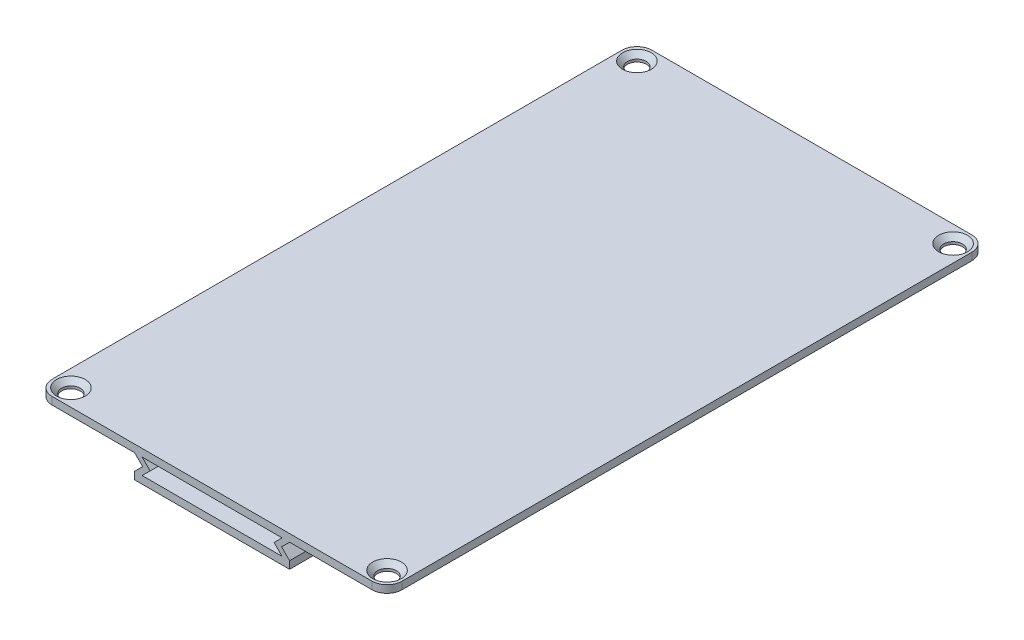
ISO-10303-21;
HEADER;
FILE_DESCRIPTION(('STEP AP214'),'2;1');
FILE_NAME('part.step','',(''),(''),'','','');
FILE_SCHEMA(('AUTOMOTIVE_DESIGN { 1 0 10303 214 1 1 1 1 }'));
ENDSEC;
DATA;
#1=APPLICATION_CONTEXT('core data for automotive mechanical design processes');
#2=APPLICATION_PROTOCOL_DEFINITION('international standard','automotive_design',2000,#1);
#3=PRODUCT_CONTEXT('',#1,'mechanical');
#4=PRODUCT('Part','Part','',(#3));
#5=PRODUCT_RELATED_PRODUCT_CATEGORY('part','',(#4));
#6=PRODUCT_DEFINITION_FORMATION('','',#4);
#7=PRODUCT_DEFINITION_CONTEXT('part definition',#1,'design');
#8=PRODUCT_DEFINITION('design','',#6,#7);
#9=PRODUCT_DEFINITION_SHAPE('','',#8);
#10=(LENGTH_UNIT() NAMED_UNIT(*) SI_UNIT(.MILLI.,.METRE.));
#11=(NAMED_UNIT(*) PLANE_ANGLE_UNIT() SI_UNIT($,.RADIAN.));
#12=(NAMED_UNIT(*) SI_UNIT($,.STERADIAN.) SOLID_ANGLE_UNIT());
#13=UNCERTAINTY_MEASURE_WITH_UNIT(LENGTH_MEASURE(1.E-05),#10,'distance_accuracy_value','');
#14=(GEOMETRIC_REPRESENTATION_CONTEXT(3) GLOBAL_UNCERTAINTY_ASSIGNED_CONTEXT((#13)) GLOBAL_UNIT_ASSIGNED_CONTEXT((#10,
#11,#12)) REPRESENTATION_CONTEXT('',''));
#15=CARTESIAN_POINT('',(0.,0.,0.));
#16=DIRECTION('',(0.,0.,1.));
#17=DIRECTION('',(1.,0.,0.));
#18=AXIS2_PLACEMENT_3D('',#15,#16,#17);
#19=CARTESIAN_POINT('',(0.,0.,60.));
#20=DIRECTION('',(0.,-1.,0.));
#21=DIRECTION('',(0.,0.,-1.));
#22=AXIS2_PLACEMENT_3D('',#19,#20,#21);
#23=PLANE('',#22);
#24=CARTESIAN_POINT('',(-31.625,0.,56.625));
#25=DIRECTION('',(0.,-1.,0.));
#26=DIRECTION('',(0.,0.,-1.));
#27=AXIS2_PLACEMENT_3D('',#24,#25,#26);
#28=CIRCLE('',#27,2.87499999999993);
#29=CARTESIAN_POINT('',(-31.625,0.,53.7500000000001));
#30=VERTEX_POINT('',#29);
#31=EDGE_CURVE('E341',#30,#30,#28,.T.);
#32=ORIENTED_EDGE('',*,*,#31,.T.);
#33=EDGE_LOOP('',(#32));
#34=FACE_BOUND('',#33,.T.);
#35=CARTESIAN_POINT('',(31.625,0.,56.625));
#36=DIRECTION('',(0.,-1.,0.));
#37=DIRECTION('',(0.,0.,-1.));
#38=AXIS2_PLACEMENT_3D('',#35,#36,#37);
#39=CIRCLE('',#38,2.87500000000003);
#40=CARTESIAN_POINT('',(31.625,0.,53.75));
#41=VERTEX_POINT('',#40);
#42=EDGE_CURVE('E338',#41,#41,#39,.T.);
#43=ORIENTED_EDGE('',*,*,#42,.T.);
#44=EDGE_LOOP('',(#43));
#45=FACE_BOUND('',#44,.T.);
#46=CARTESIAN_POINT('',(31.625,0.,-56.625));
#47=DIRECTION('',(0.,-1.,0.));
#48=DIRECTION('',(0.,0.,-1.));
#49=AXIS2_PLACEMENT_3D('',#46,#47,#48);
#50=CIRCLE('',#49,2.87500000000003);
#51=CARTESIAN_POINT('',(31.625,0.,-59.5));
#52=VERTEX_POINT('',#51);
#53=EDGE_CURVE('E335',#52,#52,#50,.T.);
#54=ORIENTED_EDGE('',*,*,#53,.T.);
#55=EDGE_LOOP('',(#54));
#56=FACE_BOUND('',#55,.T.);
#57=CARTESIAN_POINT('',(-31.625,0.,-56.625));
#58=DIRECTION('',(0.,-1.,0.));
#59=DIRECTION('',(0.,0.,-1.));
#60=AXIS2_PLACEMENT_3D('',#57,#58,#59);
#61=CIRCLE('',#60,2.87499999999997);
#62=CARTESIAN_POINT('',(-31.625,0.,-59.5));
#63=VERTEX_POINT('',#62);
#64=EDGE_CURVE('E323',#63,#63,#61,.T.);
#65=ORIENTED_EDGE('',*,*,#64,.T.);
#66=EDGE_LOOP('',(#65));
#67=FACE_BOUND('',#66,.T.);
#68=DIRECTION('',(-1.,0.,0.));
#69=VECTOR('',#68,1.);
#70=CARTESIAN_POINT('',(0.,0.,-60.));
#71=LINE('',#70,#69);
#72=CARTESIAN_POINT('',(32.,0.,-60.));
#73=VERTEX_POINT('',#72);
#74=CARTESIAN_POINT('',(-32.,0.,-60.));
#75=VERTEX_POINT('',#74);
#76=EDGE_CURVE('E277',#73,#75,#71,.T.);
#77=ORIENTED_EDGE('',*,*,#76,.T.);
#78=CARTESIAN_POINT('',(-32.,0.,-57.));
#79=DIRECTION('',(0.,-1.,0.));
#80=DIRECTION('',(0.,0.,-1.));
#81=AXIS2_PLACEMENT_3D('',#78,#79,#80);
#82=CIRCLE('',#81,3.);
#83=CARTESIAN_POINT('',(-35.,0.,-57.));
#84=VERTEX_POINT('',#83);
#85=EDGE_CURVE('E376',#75,#84,#82,.F.);
#86=ORIENTED_EDGE('',*,*,#85,.T.);
#87=DIRECTION('',(0.,0.,-1.));
#88=VECTOR('',#87,1.);
#89=CARTESIAN_POINT('',(-35.,0.,60.));
#90=LINE('',#89,#88);
#91=CARTESIAN_POINT('',(-35.,0.,57.));
#92=VERTEX_POINT('',#91);
#93=EDGE_CURVE('E320',#92,#84,#90,.T.);
#94=ORIENTED_EDGE('',*,*,#93,.F.);
#95=CARTESIAN_POINT('',(-32.,0.,57.));
#96=DIRECTION('',(0.,-1.,0.));
#97=DIRECTION('',(0.,0.,-1.));
#98=AXIS2_PLACEMENT_3D('',#95,#96,#97);
#99=CIRCLE('',#98,3.);
#100=CARTESIAN_POINT('',(-32.,0.,60.));
#101=VERTEX_POINT('',#100);
#102=EDGE_CURVE('E370',#92,#101,#99,.F.);
#103=ORIENTED_EDGE('',*,*,#102,.T.);
#104=DIRECTION('',(-1.,0.,0.));
#105=VECTOR('',#104,1.);
#106=CARTESIAN_POINT('',(0.,0.,60.));
#107=LINE('',#106,#105);
#108=CARTESIAN_POINT('',(32.,0.,60.));
#109=VERTEX_POINT('',#108);
#110=EDGE_CURVE('E259',#109,#101,#107,.T.);
#111=ORIENTED_EDGE('',*,*,#110,.F.);
#112=CARTESIAN_POINT('',(32.,0.,57.));
#113=DIRECTION('',(0.,-1.,0.));
#114=DIRECTION('',(0.,0.,-1.));
#115=AXIS2_PLACEMENT_3D('',#112,#113,#114);
#116=CIRCLE('',#115,3.);
#117=CARTESIAN_POINT('',(35.,0.,57.));
#118=VERTEX_POINT('',#117);
#119=EDGE_CURVE('E372',#109,#118,#116,.F.);
#120=ORIENTED_EDGE('',*,*,#119,.T.);
#121=DIRECTION('',(0.,0.,-1.));
#122=VECTOR('',#121,1.);
#123=CARTESIAN_POINT('',(35.,0.,60.));
#124=LINE('',#123,#122);
#125=CARTESIAN_POINT('',(35.,0.,-57.));
#126=VERTEX_POINT('',#125);
#127=EDGE_CURVE('E226',#118,#126,#124,.T.);
#128=ORIENTED_EDGE('',*,*,#127,.T.);
#129=CARTESIAN_POINT('',(32.,0.,-57.));
#130=DIRECTION('',(0.,-1.,0.));
#131=DIRECTION('',(0.,0.,-1.));
#132=AXIS2_PLACEMENT_3D('',#129,#130,#131);
#133=CIRCLE('',#132,3.);
#134=EDGE_CURVE('E374',#126,#73,#133,.F.);
#135=ORIENTED_EDGE('',*,*,#134,.T.);
#136=EDGE_LOOP('',(#77,#86,#94,#103,#111,#120,#128,#135));
#137=FACE_BOUND('',#136,.T.);
#138=ADVANCED_FACE('F35',(#34,#45,#56,#67,#137),#23,.F.);
#139=CARTESIAN_POINT('',(-35.,0.,60.));
#140=DIRECTION('',(1.,0.,0.));
#141=DIRECTION('',(0.,0.,-1.));
#142=AXIS2_PLACEMENT_3D('',#139,#140,#141);
#143=PLANE('',#142);
#144=ORIENTED_EDGE('',*,*,#93,.T.);
#145=DIRECTION('',(0.,-1.,0.));
#146=VECTOR('',#145,1.);
#147=CARTESIAN_POINT('',(-35.,-1.5,-57.));
#148=LINE('',#147,#146);
#149=CARTESIAN_POINT('',(-35.,-1.5,-57.));
#150=VERTEX_POINT('',#149);
#151=EDGE_CURVE('E358',#84,#150,#148,.T.);
#152=ORIENTED_EDGE('',*,*,#151,.T.);
#153=DIRECTION('',(0.,0.,-1.));
#154=VECTOR('',#153,1.);
#155=CARTESIAN_POINT('',(-35.,-1.5,60.));
#156=LINE('',#155,#154);
#157=CARTESIAN_POINT('',(-35.,-1.5,57.));
#158=VERTEX_POINT('',#157);
#159=EDGE_CURVE('E317',#158,#150,#156,.T.);
#160=ORIENTED_EDGE('',*,*,#159,.F.);
#161=DIRECTION('',(0.,-1.,0.));
#162=VECTOR('',#161,1.);
#163=CARTESIAN_POINT('',(-35.,0.,57.));
#164=LINE('',#163,#162);
#165=EDGE_CURVE('E356',#158,#92,#164,.F.);
#166=ORIENTED_EDGE('',*,*,#165,.T.);
#167=EDGE_LOOP('',(#144,#152,#160,#166));
#168=FACE_BOUND('',#167,.T.);
#169=ADVANCED_FACE('F453',(#168),#143,.F.);
#170=CARTESIAN_POINT('',(-35.,-1.5,60.));
#171=DIRECTION('',(0.,1.,0.));
#172=DIRECTION('',(0.,0.,1.));
#173=AXIS2_PLACEMENT_3D('',#170,#171,#172);
#174=PLANE('',#173);
#175=CARTESIAN_POINT('',(-31.625,-1.5,-56.625));
#176=DIRECTION('',(0.,1.,0.));
#177=DIRECTION('',(0.,0.,1.));
#178=AXIS2_PLACEMENT_3D('',#175,#176,#177);
#179=CIRCLE('',#178,1.875);
#180=CARTESIAN_POINT('',(-31.625,-1.5,-54.75));
#181=VERTEX_POINT('',#180);
#182=EDGE_CURVE('E281',#181,#181,#179,.T.);
#183=ORIENTED_EDGE('',*,*,#182,.T.);
#184=EDGE_LOOP('',(#183));
#185=FACE_BOUND('',#184,.T.);
#186=CARTESIAN_POINT('',(-31.625,-1.5,56.625));
#187=DIRECTION('',(0.,1.,0.));
#188=DIRECTION('',(0.,0.,1.));
#189=AXIS2_PLACEMENT_3D('',#186,#187,#188);
#190=CIRCLE('',#189,1.875);
#191=CARTESIAN_POINT('',(-31.625,-1.5,58.5));
#192=VERTEX_POINT('',#191);
#193=EDGE_CURVE('E204',#192,#192,#190,.T.);
#194=ORIENTED_EDGE('',*,*,#193,.T.);
#195=EDGE_LOOP('',(#194));
#196=FACE_BOUND('',#195,.T.);
#197=ORIENTED_EDGE('',*,*,#159,.T.);
#198=CARTESIAN_POINT('',(-32.,-1.5,-57.));
#199=DIRECTION('',(0.,1.,0.));
#200=DIRECTION('',(0.,0.,1.));
#201=AXIS2_PLACEMENT_3D('',#198,#199,#200);
#202=CIRCLE('',#201,3.);
#203=CARTESIAN_POINT('',(-32.,-1.5,-60.));
#204=VERTEX_POINT('',#203);
#205=EDGE_CURVE('E363',#150,#204,#202,.F.);
#206=ORIENTED_EDGE('',*,*,#205,.T.);
#207=DIRECTION('',(1.,0.,0.));
#208=VECTOR('',#207,1.);
#209=CARTESIAN_POINT('',(-35.,-1.5,-60.));
#210=LINE('',#209,#208);
#211=CARTESIAN_POINT('',(-15.5,-1.5,-60.));
#212=VERTEX_POINT('',#211);
#213=EDGE_CURVE('E280',#204,#212,#210,.T.);
#214=ORIENTED_EDGE('',*,*,#213,.T.);
#215=DIRECTION('',(0.,0.,-1.));
#216=VECTOR('',#215,1.);
#217=CARTESIAN_POINT('',(-15.5,-1.5,60.));
#218=LINE('',#217,#216);
#219=CARTESIAN_POINT('',(-15.5,-1.5,60.));
#220=VERTEX_POINT('',#219);
#221=EDGE_CURVE('E314',#220,#212,#218,.T.);
#222=ORIENTED_EDGE('',*,*,#221,.F.);
#223=DIRECTION('',(1.,0.,0.));
#224=VECTOR('',#223,1.);
#225=CARTESIAN_POINT('',(-35.,-1.5,60.));
#226=LINE('',#225,#224);
#227=CARTESIAN_POINT('',(-32.,-1.5,60.));
#228=VERTEX_POINT('',#227);
#229=EDGE_CURVE('E262',#228,#220,#226,.T.);
#230=ORIENTED_EDGE('',*,*,#229,.F.);
#231=CARTESIAN_POINT('',(-32.,-1.5,57.));
#232=DIRECTION('',(0.,1.,0.));
#233=DIRECTION('',(0.,0.,1.));
#234=AXIS2_PLACEMENT_3D('',#231,#232,#233);
#235=CIRCLE('',#234,3.);
#236=EDGE_CURVE('E361',#228,#158,#235,.F.);
#237=ORIENTED_EDGE('',*,*,#236,.T.);
#238=EDGE_LOOP('',(#197,#206,#214,#222,#230,#237));
#239=FACE_BOUND('',#238,.T.);
#240=ADVANCED_FACE('F393',(#185,#196,#239),#174,.F.);
#241=CARTESIAN_POINT('',(-15.5,-1.5,60.));
#242=DIRECTION('',(0.707106781186547,0.707106781186548,0.));
#243=DIRECTION('',(-0.707106781186548,0.707106781186547,0.));
#244=AXIS2_PLACEMENT_3D('',#241,#242,#243);
#245=PLANE('',#244);
#246=DIRECTION('',(0.707106781186548,-0.707106781186547,0.));
#247=VECTOR('',#246,1.);
#248=CARTESIAN_POINT('',(-15.5,-1.5,-60.));
#249=LINE('',#248,#247);
#250=CARTESIAN_POINT('',(-13.9,-3.1,-60.));
#251=VERTEX_POINT('',#250);
#252=EDGE_CURVE('E283',#212,#251,#249,.T.);
#253=ORIENTED_EDGE('',*,*,#252,.T.);
#254=DIRECTION('',(0.,0.,-1.));
#255=VECTOR('',#254,1.);
#256=CARTESIAN_POINT('',(-13.9,-3.1,60.));
#257=LINE('',#256,#255);
#258=CARTESIAN_POINT('',(-13.9,-3.1,60.));
#259=VERTEX_POINT('',#258);
#260=EDGE_CURVE('E311',#259,#251,#257,.T.);
#261=ORIENTED_EDGE('',*,*,#260,.F.);
#262=DIRECTION('',(0.707106781186548,-0.707106781186547,0.));
#263=VECTOR('',#262,1.);
#264=CARTESIAN_POINT('',(-15.5,-1.5,60.));
#265=LINE('',#264,#263);
#266=EDGE_CURVE('E264',#220,#259,#265,.T.);
#267=ORIENTED_EDGE('',*,*,#266,.F.);
#268=ORIENTED_EDGE('',*,*,#221,.T.);
#269=EDGE_LOOP('',(#253,#261,#267,#268));
#270=FACE_BOUND('',#269,.T.);
#271=ADVANCED_FACE('F400',(#270),#245,.F.);
#272=CARTESIAN_POINT('',(-13.9,-3.1,60.));
#273=DIRECTION('',(0.707106781186547,-0.707106781186548,0.));
#274=DIRECTION('',(0.707106781186548,0.707106781186547,0.));
#275=AXIS2_PLACEMENT_3D('',#272,#273,#274);
#276=PLANE('',#275);
#277=DIRECTION('',(-0.707106781186548,-0.707106781186547,0.));
#278=VECTOR('',#277,1.);
#279=CARTESIAN_POINT('',(-13.9,-3.1,-60.));
#280=LINE('',#279,#278);
#281=CARTESIAN_POINT('',(-15.5,-4.7,-60.));
#282=VERTEX_POINT('',#281);
#283=EDGE_CURVE('E285',#251,#282,#280,.T.);
#284=ORIENTED_EDGE('',*,*,#283,.T.);
#285=DIRECTION('',(0.,0.,-1.));
#286=VECTOR('',#285,1.);
#287=CARTESIAN_POINT('',(-15.5,-4.7,60.));
#288=LINE('',#287,#286);
#289=CARTESIAN_POINT('',(-15.5,-4.7,60.));
#290=VERTEX_POINT('',#289);
#291=EDGE_CURVE('E308',#290,#282,#288,.T.);
#292=ORIENTED_EDGE('',*,*,#291,.F.);
#293=DIRECTION('',(-0.707106781186548,-0.707106781186547,0.));
#294=VECTOR('',#293,1.);
#295=CARTESIAN_POINT('',(-13.9,-3.1,60.));
#296=LINE('',#295,#294);
#297=EDGE_CURVE('E266',#259,#290,#296,.T.);
#298=ORIENTED_EDGE('',*,*,#297,.F.);
#299=ORIENTED_EDGE('',*,*,#260,.T.);
#300=EDGE_LOOP('',(#284,#292,#298,#299));
#301=FACE_BOUND('',#300,.T.);
#302=ADVANCED_FACE('F406',(#301),#276,.F.);
#303=CARTESIAN_POINT('',(-15.5,-4.7,60.));
#304=DIRECTION('',(1.,0.,0.));
#305=DIRECTION('',(0.,0.,-1.));
#306=AXIS2_PLACEMENT_3D('',#303,#304,#305);
#307=PLANE('',#306);
#308=DIRECTION('',(0.,-1.,0.));
#309=VECTOR('',#308,1.);
#310=CARTESIAN_POINT('',(-15.5,-4.7,-60.));
#311=LINE('',#310,#309);
#312=CARTESIAN_POINT('',(-15.5,-6.2,-60.));
#313=VERTEX_POINT('',#312);
#314=EDGE_CURVE('E287',#282,#313,#311,.T.);
#315=ORIENTED_EDGE('',*,*,#314,.T.);
#316=DIRECTION('',(0.,0.,-1.));
#317=VECTOR('',#316,1.);
#318=CARTESIAN_POINT('',(-15.5,-6.2,60.));
#319=LINE('',#318,#317);
#320=CARTESIAN_POINT('',(-15.5,-6.2,60.));
#321=VERTEX_POINT('',#320);
#322=EDGE_CURVE('E305',#321,#313,#319,.T.);
#323=ORIENTED_EDGE('',*,*,#322,.F.);
#324=DIRECTION('',(0.,-1.,0.));
#325=VECTOR('',#324,1.);
#326=CARTESIAN_POINT('',(-15.5,-4.7,60.));
#327=LINE('',#326,#325);
#328=EDGE_CURVE('E268',#290,#321,#327,.T.);
#329=ORIENTED_EDGE('',*,*,#328,.F.);
#330=ORIENTED_EDGE('',*,*,#291,.T.);
#331=EDGE_LOOP('',(#315,#323,#329,#330));
#332=FACE_BOUND('',#331,.T.);
#333=ADVANCED_FACE('F410',(#332),#307,.F.);
#334=CARTESIAN_POINT('',(-15.5,-6.2,60.));
#335=DIRECTION('',(0.,1.,0.));
#336=DIRECTION('',(0.,0.,1.));
#337=AXIS2_PLACEMENT_3D('',#334,#335,#336);
#338=PLANE('',#337);
#339=DIRECTION('',(1.,0.,0.));
#340=VECTOR('',#339,1.);
#341=CARTESIAN_POINT('',(-15.5,-6.2,-60.));
#342=LINE('',#341,#340);
#343=CARTESIAN_POINT('',(15.5,-6.20000000000001,-60.));
#344=VERTEX_POINT('',#343);
#345=EDGE_CURVE('E289',#313,#344,#342,.T.);
#346=ORIENTED_EDGE('',*,*,#345,.T.);
#347=DIRECTION('',(0.,0.,-1.));
#348=VECTOR('',#347,1.);
#349=CARTESIAN_POINT('',(15.5,-6.20000000000001,60.));
#350=LINE('',#349,#348);
#351=CARTESIAN_POINT('',(15.5,-6.20000000000001,60.));
#352=VERTEX_POINT('',#351);
#353=EDGE_CURVE('E252',#352,#344,#350,.T.);
#354=ORIENTED_EDGE('',*,*,#353,.F.);
#355=DIRECTION('',(1.,0.,0.));
#356=VECTOR('',#355,1.);
#357=CARTESIAN_POINT('',(-15.5,-6.2,60.));
#358=LINE('',#357,#356);
#359=EDGE_CURVE('E270',#321,#352,#358,.T.);
#360=ORIENTED_EDGE('',*,*,#359,.F.);
#361=ORIENTED_EDGE('',*,*,#322,.T.);
#362=EDGE_LOOP('',(#346,#354,#360,#361));
#363=FACE_BOUND('',#362,.T.);
#364=ADVANCED_FACE('F415',(#363),#338,.F.);
#365=CARTESIAN_POINT('',(-14.,-4.7,60.));
#366=DIRECTION('',(0.,-1.,0.));
#367=DIRECTION('',(0.,0.,-1.));
#368=AXIS2_PLACEMENT_3D('',#365,#366,#367);
#369=PLANE('',#368);
#370=DIRECTION('',(-1.,0.,0.));
#371=VECTOR('',#370,1.);
#372=CARTESIAN_POINT('',(-14.,-4.7,-60.));
#373=LINE('',#372,#371);
#374=CARTESIAN_POINT('',(14.,-4.70000000000001,-60.));
#375=VERTEX_POINT('',#374);
#376=CARTESIAN_POINT('',(-14.,-4.7,-60.));
#377=VERTEX_POINT('',#376);
#378=EDGE_CURVE('E291',#375,#377,#373,.T.);
#379=ORIENTED_EDGE('',*,*,#378,.T.);
#380=DIRECTION('',(0.,0.,-1.));
#381=VECTOR('',#380,1.);
#382=CARTESIAN_POINT('',(-14.,-4.7,60.));
#383=LINE('',#382,#381);
#384=CARTESIAN_POINT('',(-14.,-4.7,60.));
#385=VERTEX_POINT('',#384);
#386=EDGE_CURVE('E302',#385,#377,#383,.T.);
#387=ORIENTED_EDGE('',*,*,#386,.F.);
#388=DIRECTION('',(-1.,0.,0.));
#389=VECTOR('',#388,1.);
#390=CARTESIAN_POINT('',(-14.,-4.7,60.));
#391=LINE('',#390,#389);
#392=CARTESIAN_POINT('',(14.,-4.70000000000001,60.));
#393=VERTEX_POINT('',#392);
#394=EDGE_CURVE('E272',#393,#385,#391,.T.);
#395=ORIENTED_EDGE('',*,*,#394,.F.);
#396=DIRECTION('',(0.,0.,-1.));
#397=VECTOR('',#396,1.);
#398=CARTESIAN_POINT('',(14.,-4.70000000000001,60.));
#399=LINE('',#398,#397);
#400=EDGE_CURVE('E255',#393,#375,#399,.T.);
#401=ORIENTED_EDGE('',*,*,#400,.T.);
#402=EDGE_LOOP('',(#379,#387,#395,#401));
#403=FACE_BOUND('',#402,.T.);
#404=ADVANCED_FACE('F653',(#403),#369,.F.);
#405=CARTESIAN_POINT('',(-12.4,-3.1,60.));
#406=DIRECTION('',(-0.707106781186549,0.707106781186546,0.));
#407=DIRECTION('',(-0.707106781186546,-0.707106781186549,0.));
#408=AXIS2_PLACEMENT_3D('',#405,#406,#407);
#409=PLANE('',#408);
#410=DIRECTION('',(0.707106781186546,0.707106781186549,0.));
#411=VECTOR('',#410,1.);
#412=CARTESIAN_POINT('',(-12.4,-3.1,-60.));
#413=LINE('',#412,#411);
#414=CARTESIAN_POINT('',(-12.4,-3.1,-60.));
#415=VERTEX_POINT('',#414);
#416=EDGE_CURVE('E293',#377,#415,#413,.T.);
#417=ORIENTED_EDGE('',*,*,#416,.T.);
#418=DIRECTION('',(0.,0.,-1.));
#419=VECTOR('',#418,1.);
#420=CARTESIAN_POINT('',(-12.4,-3.1,60.));
#421=LINE('',#420,#419);
#422=CARTESIAN_POINT('',(-12.4,-3.1,60.));
#423=VERTEX_POINT('',#422);
#424=EDGE_CURVE('E299',#423,#415,#421,.T.);
#425=ORIENTED_EDGE('',*,*,#424,.F.);
#426=DIRECTION('',(0.707106781186546,0.707106781186549,0.));
#427=VECTOR('',#426,1.);
#428=CARTESIAN_POINT('',(-12.4,-3.1,60.));
#429=LINE('',#428,#427);
#430=EDGE_CURVE('E274',#385,#423,#429,.T.);
#431=ORIENTED_EDGE('',*,*,#430,.F.);
#432=ORIENTED_EDGE('',*,*,#386,.T.);
#433=EDGE_LOOP('',(#417,#425,#431,#432));
#434=FACE_BOUND('',#433,.T.);
#435=ADVANCED_FACE('F659',(#434),#409,.F.);
#436=CARTESIAN_POINT('',(-14.,-1.5,60.));
#437=DIRECTION('',(-0.707106781186549,-0.707106781186546,0.));
#438=DIRECTION('',(0.707106781186546,-0.707106781186549,0.));
#439=AXIS2_PLACEMENT_3D('',#436,#437,#438);
#440=PLANE('',#439);
#441=DIRECTION('',(-0.707106781186546,0.707106781186549,0.));
#442=VECTOR('',#441,1.);
#443=CARTESIAN_POINT('',(-14.,-1.5,-60.));
#444=LINE('',#443,#442);
#445=CARTESIAN_POINT('',(-14.,-1.5,-60.));
#446=VERTEX_POINT('',#445);
#447=EDGE_CURVE('E295',#415,#446,#444,.T.);
#448=ORIENTED_EDGE('',*,*,#447,.T.);
#449=DIRECTION('',(0.,0.,-1.));
#450=VECTOR('',#449,1.);
#451=CARTESIAN_POINT('',(-14.,-1.5,60.));
#452=LINE('',#451,#450);
#453=CARTESIAN_POINT('',(-14.,-1.5,60.));
#454=VERTEX_POINT('',#453);
#455=EDGE_CURVE('E194',#454,#446,#452,.T.);
#456=ORIENTED_EDGE('',*,*,#455,.F.);
#457=DIRECTION('',(-0.707106781186546,0.707106781186549,0.));
#458=VECTOR('',#457,1.);
#459=CARTESIAN_POINT('',(-14.,-1.5,60.));
#460=LINE('',#459,#458);
#461=EDGE_CURVE('E190',#423,#454,#460,.T.);
#462=ORIENTED_EDGE('',*,*,#461,.F.);
#463=ORIENTED_EDGE('',*,*,#424,.T.);
#464=EDGE_LOOP('',(#448,#456,#462,#463));
#465=FACE_BOUND('',#464,.T.);
#466=ADVANCED_FACE('F646',(#465),#440,.F.);
#467=CARTESIAN_POINT('',(0.,-1.5,60.));
#468=DIRECTION('',(0.,1.,0.));
#469=DIRECTION('',(-1.,0.,0.));
#470=AXIS2_PLACEMENT_3D('',#467,#468,#469);
#471=PLANE('',#470);
#472=DIRECTION('',(1.,0.,0.));
#473=VECTOR('',#472,1.);
#474=CARTESIAN_POINT('',(0.,-1.5,-60.));
#475=LINE('',#474,#473);
#476=CARTESIAN_POINT('',(14.,-1.50000000000001,-60.));
#477=VERTEX_POINT('',#476);
#478=EDGE_CURVE('E200',#446,#477,#475,.T.);
#479=ORIENTED_EDGE('',*,*,#478,.T.);
#480=DIRECTION('',(0.,0.,-1.));
#481=VECTOR('',#480,1.);
#482=CARTESIAN_POINT('',(14.,-1.50000000000001,60.));
#483=LINE('',#482,#481);
#484=CARTESIAN_POINT('',(14.,-1.50000000000001,60.));
#485=VERTEX_POINT('',#484);
#486=EDGE_CURVE('E197',#485,#477,#483,.T.);
#487=ORIENTED_EDGE('',*,*,#486,.F.);
#488=DIRECTION('',(1.,0.,0.));
#489=VECTOR('',#488,1.);
#490=CARTESIAN_POINT('',(0.,-1.5,60.));
#491=LINE('',#490,#489);
#492=EDGE_CURVE('E182',#454,#485,#491,.T.);
#493=ORIENTED_EDGE('',*,*,#492,.F.);
#494=ORIENTED_EDGE('',*,*,#455,.T.);
#495=EDGE_LOOP('',(#479,#487,#493,#494));
#496=FACE_BOUND('',#495,.T.);
#497=ADVANCED_FACE('F198',(#496),#471,.F.);
#498=CARTESIAN_POINT('',(0.,0.,60.));
#499=DIRECTION('',(0.,0.,-1.));
#500=DIRECTION('',(-1.,0.,0.));
#501=AXIS2_PLACEMENT_3D('',#498,#499,#500);
#502=PLANE('',#501);
#503=DIRECTION('',(-1.,0.,0.));
#504=VECTOR('',#503,1.);
#505=CARTESIAN_POINT('',(35.,-1.50000000000003,60.));
#506=LINE('',#505,#504);
#507=CARTESIAN_POINT('',(32.,-1.50000000000003,60.));
#508=VERTEX_POINT('',#507);
#509=CARTESIAN_POINT('',(15.5,-1.50000000000001,60.));
#510=VERTEX_POINT('',#509);
#511=EDGE_CURVE('E224',#508,#510,#506,.T.);
#512=ORIENTED_EDGE('',*,*,#511,.F.);
#513=DIRECTION('',(0.,-1.,0.));
#514=VECTOR('',#513,1.);
#515=CARTESIAN_POINT('',(32.,0.,60.));
#516=LINE('',#515,#514);
#517=EDGE_CURVE('E11',#508,#109,#516,.F.);
#518=ORIENTED_EDGE('',*,*,#517,.T.);
#519=ORIENTED_EDGE('',*,*,#110,.T.);
#520=DIRECTION('',(0.,-1.,0.));
#521=VECTOR('',#520,1.);
#522=CARTESIAN_POINT('',(-32.,0.,60.));
#523=LINE('',#522,#521);
#524=EDGE_CURVE('E43',#101,#228,#523,.T.);
#525=ORIENTED_EDGE('',*,*,#524,.T.);
#526=ORIENTED_EDGE('',*,*,#229,.T.);
#527=ORIENTED_EDGE('',*,*,#266,.T.);
#528=ORIENTED_EDGE('',*,*,#297,.T.);
#529=ORIENTED_EDGE('',*,*,#328,.T.);
#530=ORIENTED_EDGE('',*,*,#359,.T.);
#531=DIRECTION('',(0.,-1.,0.));
#532=VECTOR('',#531,1.);
#533=CARTESIAN_POINT('',(15.5,-4.70000000000001,60.));
#534=LINE('',#533,#532);
#535=CARTESIAN_POINT('',(15.5,-4.70000000000001,60.));
#536=VERTEX_POINT('',#535);
#537=EDGE_CURVE('E211',#536,#352,#534,.T.);
#538=ORIENTED_EDGE('',*,*,#537,.F.);
#539=DIRECTION('',(0.707106781186547,-0.707106781186548,0.));
#540=VECTOR('',#539,1.);
#541=CARTESIAN_POINT('',(13.9,-3.10000000000001,60.));
#542=LINE('',#541,#540);
#543=CARTESIAN_POINT('',(13.9,-3.10000000000001,60.));
#544=VERTEX_POINT('',#543);
#545=EDGE_CURVE('E218',#544,#536,#542,.T.);
#546=ORIENTED_EDGE('',*,*,#545,.F.);
#547=DIRECTION('',(-0.707106781186548,-0.707106781186547,0.));
#548=VECTOR('',#547,1.);
#549=CARTESIAN_POINT('',(15.5,-1.50000000000001,60.));
#550=LINE('',#549,#548);
#551=EDGE_CURVE('E221',#510,#544,#550,.T.);
#552=ORIENTED_EDGE('',*,*,#551,.F.);
#553=EDGE_LOOP('',(#512,#518,#519,#525,#526,#527,#528,#529,#530,#538,#546,#552));
#554=FACE_BOUND('',#553,.T.);
#555=ORIENTED_EDGE('',*,*,#492,.T.);
#556=DIRECTION('',(0.707106781186547,0.707106781186548,0.));
#557=VECTOR('',#556,1.);
#558=CARTESIAN_POINT('',(14.,-1.50000000000001,60.));
#559=LINE('',#558,#557);
#560=CARTESIAN_POINT('',(12.4,-3.10000000000001,60.));
#561=VERTEX_POINT('',#560);
#562=EDGE_CURVE('E187',#561,#485,#559,.T.);
#563=ORIENTED_EDGE('',*,*,#562,.F.);
#564=DIRECTION('',(-0.707106781186546,0.707106781186549,0.));
#565=VECTOR('',#564,1.);
#566=CARTESIAN_POINT('',(12.4,-3.10000000000001,60.));
#567=LINE('',#566,#565);
#568=EDGE_CURVE('E208',#393,#561,#567,.T.);
#569=ORIENTED_EDGE('',*,*,#568,.F.);
#570=ORIENTED_EDGE('',*,*,#394,.T.);
#571=ORIENTED_EDGE('',*,*,#430,.T.);
#572=ORIENTED_EDGE('',*,*,#461,.T.);
#573=EDGE_LOOP('',(#555,#563,#569,#570,#571,#572));
#574=FACE_BOUND('',#573,.T.);
#575=ADVANCED_FACE('F184',(#554,#574),#502,.F.);
#576=CARTESIAN_POINT('',(0.,0.,-60.));
#577=DIRECTION('',(0.,0.,-1.));
#578=DIRECTION('',(-1.,0.,0.));
#579=AXIS2_PLACEMENT_3D('',#576,#577,#578);
#580=PLANE('',#579);
#581=ORIENTED_EDGE('',*,*,#213,.F.);
#582=DIRECTION('',(0.,-1.,0.));
#583=VECTOR('',#582,1.);
#584=CARTESIAN_POINT('',(-32.,0.,-60.));
#585=LINE('',#584,#583);
#586=EDGE_CURVE('E368',#204,#75,#585,.F.);
#587=ORIENTED_EDGE('',*,*,#586,.T.);
#588=ORIENTED_EDGE('',*,*,#76,.F.);
#589=DIRECTION('',(0.,-1.,0.));
#590=VECTOR('',#589,1.);
#591=CARTESIAN_POINT('',(32.,0.,-60.));
#592=LINE('',#591,#590);
#593=CARTESIAN_POINT('',(32.,-1.50000000000003,-60.));
#594=VERTEX_POINT('',#593);
#595=EDGE_CURVE('E365',#73,#594,#592,.T.);
#596=ORIENTED_EDGE('',*,*,#595,.T.);
#597=DIRECTION('',(-1.,0.,0.));
#598=VECTOR('',#597,1.);
#599=CARTESIAN_POINT('',(35.,-1.50000000000003,-60.));
#600=LINE('',#599,#598);
#601=CARTESIAN_POINT('',(15.5,-1.50000000000001,-60.));
#602=VERTEX_POINT('',#601);
#603=EDGE_CURVE('E209',#594,#602,#600,.T.);
#604=ORIENTED_EDGE('',*,*,#603,.T.);
#605=DIRECTION('',(-0.707106781186548,-0.707106781186547,0.));
#606=VECTOR('',#605,1.);
#607=CARTESIAN_POINT('',(15.5,-1.50000000000001,-60.));
#608=LINE('',#607,#606);
#609=CARTESIAN_POINT('',(13.9,-3.10000000000001,-60.));
#610=VERTEX_POINT('',#609);
#611=EDGE_CURVE('E213',#602,#610,#608,.T.);
#612=ORIENTED_EDGE('',*,*,#611,.T.);
#613=DIRECTION('',(0.707106781186547,-0.707106781186548,0.));
#614=VECTOR('',#613,1.);
#615=CARTESIAN_POINT('',(13.9,-3.10000000000001,-60.));
#616=LINE('',#615,#614);
#617=CARTESIAN_POINT('',(15.5,-4.70000000000001,-60.));
#618=VERTEX_POINT('',#617);
#619=EDGE_CURVE('E236',#610,#618,#616,.T.);
#620=ORIENTED_EDGE('',*,*,#619,.T.);
#621=DIRECTION('',(0.,-1.,0.));
#622=VECTOR('',#621,1.);
#623=CARTESIAN_POINT('',(15.5,-4.70000000000001,-60.));
#624=LINE('',#623,#622);
#625=EDGE_CURVE('E233',#618,#344,#624,.T.);
#626=ORIENTED_EDGE('',*,*,#625,.T.);
#627=ORIENTED_EDGE('',*,*,#345,.F.);
#628=ORIENTED_EDGE('',*,*,#314,.F.);
#629=ORIENTED_EDGE('',*,*,#283,.F.);
#630=ORIENTED_EDGE('',*,*,#252,.F.);
#631=EDGE_LOOP('',(#581,#587,#588,#596,#604,#612,#620,#626,#627,#628,#629,#630));
#632=FACE_BOUND('',#631,.T.);
#633=DIRECTION('',(0.707106781186547,0.707106781186548,0.));
#634=VECTOR('',#633,1.);
#635=CARTESIAN_POINT('',(14.,-1.50000000000001,-60.));
#636=LINE('',#635,#634);
#637=CARTESIAN_POINT('',(12.4,-3.10000000000001,-60.));
#638=VERTEX_POINT('',#637);
#639=EDGE_CURVE('E227',#638,#477,#636,.T.);
#640=ORIENTED_EDGE('',*,*,#639,.T.);
#641=ORIENTED_EDGE('',*,*,#478,.F.);
#642=ORIENTED_EDGE('',*,*,#447,.F.);
#643=ORIENTED_EDGE('',*,*,#416,.F.);
#644=ORIENTED_EDGE('',*,*,#378,.F.);
#645=DIRECTION('',(-0.707106781186546,0.707106781186549,0.));
#646=VECTOR('',#645,1.);
#647=CARTESIAN_POINT('',(12.4,-3.10000000000001,-60.));
#648=LINE('',#647,#646);
#649=EDGE_CURVE('E229',#375,#638,#648,.T.);
#650=ORIENTED_EDGE('',*,*,#649,.T.);
#651=EDGE_LOOP('',(#640,#641,#642,#643,#644,#650));
#652=FACE_BOUND('',#651,.T.);
#653=ADVANCED_FACE('F445',(#632,#652),#580,.T.);
#654=CARTESIAN_POINT('',(-31.625,-6.2,56.625));
#655=DIRECTION('',(0.,1.,0.));
#656=DIRECTION('',(0.,0.,1.));
#657=AXIS2_PLACEMENT_3D('',#654,#655,#656);
#658=CYLINDRICAL_SURFACE('',#657,1.875);
#659=CARTESIAN_POINT('',(-31.625,-0.999999999999938,56.625));
#660=DIRECTION('',(0.,-1.,0.));
#661=DIRECTION('',(0.,0.,-1.));
#662=AXIS2_PLACEMENT_3D('',#659,#660,#661);
#663=CIRCLE('',#662,1.875);
#664=CARTESIAN_POINT('',(-31.625,-0.999999999999938,54.75));
#665=VERTEX_POINT('',#664);
#666=EDGE_CURVE('E344',#665,#665,#663,.F.);
#667=ORIENTED_EDGE('',*,*,#666,.T.);
#668=EDGE_LOOP('',(#667));
#669=FACE_BOUND('',#668,.T.);
#670=ORIENTED_EDGE('',*,*,#193,.F.);
#671=EDGE_LOOP('',(#670));
#672=FACE_BOUND('',#671,.T.);
#673=ADVANCED_FACE('F624',(#669,#672),#658,.F.);
#674=CARTESIAN_POINT('',(-31.625,-6.2,-56.625));
#675=DIRECTION('',(0.,1.,0.));
#676=DIRECTION('',(0.,0.,1.));
#677=AXIS2_PLACEMENT_3D('',#674,#675,#676);
#678=CYLINDRICAL_SURFACE('',#677,1.875);
#679=CARTESIAN_POINT('',(-31.625,-0.999999999999965,-56.625));
#680=DIRECTION('',(0.,-1.,0.));
#681=DIRECTION('',(0.,0.,-1.));
#682=AXIS2_PLACEMENT_3D('',#679,#680,#681);
#683=CIRCLE('',#682,1.875);
#684=CARTESIAN_POINT('',(-31.625,-0.999999999999965,-58.5));
#685=VERTEX_POINT('',#684);
#686=EDGE_CURVE('E353',#685,#685,#683,.F.);
#687=ORIENTED_EDGE('',*,*,#686,.T.);
#688=EDGE_LOOP('',(#687));
#689=FACE_BOUND('',#688,.T.);
#690=ORIENTED_EDGE('',*,*,#182,.F.);
#691=EDGE_LOOP('',(#690));
#692=FACE_BOUND('',#691,.T.);
#693=ADVANCED_FACE('F614',(#689,#692),#678,.F.);
#694=CARTESIAN_POINT('',(14.,-1.50000000000001,60.));
#695=DIRECTION('',(-0.707106781186548,0.707106781186547,0.));
#696=DIRECTION('',(-0.707106781186547,-0.707106781186548,0.));
#697=AXIS2_PLACEMENT_3D('',#694,#695,#696);
#698=PLANE('',#697);
#699=ORIENTED_EDGE('',*,*,#639,.F.);
#700=DIRECTION('',(0.,0.,-1.));
#701=VECTOR('',#700,1.);
#702=CARTESIAN_POINT('',(12.4,-3.10000000000001,60.));
#703=LINE('',#702,#701);
#704=EDGE_CURVE('E205',#561,#638,#703,.T.);
#705=ORIENTED_EDGE('',*,*,#704,.F.);
#706=ORIENTED_EDGE('',*,*,#562,.T.);
#707=ORIENTED_EDGE('',*,*,#486,.T.);
#708=EDGE_LOOP('',(#699,#705,#706,#707));
#709=FACE_BOUND('',#708,.T.);
#710=ADVANCED_FACE('F207',(#709),#698,.T.);
#711=CARTESIAN_POINT('',(12.4,-3.10000000000001,60.));
#712=DIRECTION('',(-0.707106781186549,-0.707106781186546,0.));
#713=DIRECTION('',(0.707106781186546,-0.707106781186549,0.));
#714=AXIS2_PLACEMENT_3D('',#711,#712,#713);
#715=PLANE('',#714);
#716=ORIENTED_EDGE('',*,*,#649,.F.);
#717=ORIENTED_EDGE('',*,*,#400,.F.);
#718=ORIENTED_EDGE('',*,*,#568,.T.);
#719=ORIENTED_EDGE('',*,*,#704,.T.);
#720=EDGE_LOOP('',(#716,#717,#718,#719));
#721=FACE_BOUND('',#720,.T.);
#722=ADVANCED_FACE('F598',(#721),#715,.T.);
#723=CARTESIAN_POINT('',(15.5,-4.70000000000001,60.));
#724=DIRECTION('',(1.,0.,0.));
#725=DIRECTION('',(0.,1.,0.));
#726=AXIS2_PLACEMENT_3D('',#723,#724,#725);
#727=PLANE('',#726);
#728=ORIENTED_EDGE('',*,*,#625,.F.);
#729=DIRECTION('',(0.,0.,-1.));
#730=VECTOR('',#729,1.);
#731=CARTESIAN_POINT('',(15.5,-4.70000000000001,60.));
#732=LINE('',#731,#730);
#733=EDGE_CURVE('E250',#536,#618,#732,.T.);
#734=ORIENTED_EDGE('',*,*,#733,.F.);
#735=ORIENTED_EDGE('',*,*,#537,.T.);
#736=ORIENTED_EDGE('',*,*,#353,.T.);
#737=EDGE_LOOP('',(#728,#734,#735,#736));
#738=FACE_BOUND('',#737,.T.);
#739=ADVANCED_FACE('F590',(#738),#727,.T.);
#740=CARTESIAN_POINT('',(13.9,-3.10000000000001,60.));
#741=DIRECTION('',(0.707106781186548,0.707106781186547,0.));
#742=DIRECTION('',(-0.707106781186547,0.707106781186548,0.));
#743=AXIS2_PLACEMENT_3D('',#740,#741,#742);
#744=PLANE('',#743);
#745=ORIENTED_EDGE('',*,*,#619,.F.);
#746=DIRECTION('',(0.,0.,-1.));
#747=VECTOR('',#746,1.);
#748=CARTESIAN_POINT('',(13.9,-3.10000000000001,60.));
#749=LINE('',#748,#747);
#750=EDGE_CURVE('E248',#544,#610,#749,.T.);
#751=ORIENTED_EDGE('',*,*,#750,.F.);
#752=ORIENTED_EDGE('',*,*,#545,.T.);
#753=ORIENTED_EDGE('',*,*,#733,.T.);
#754=EDGE_LOOP('',(#745,#751,#752,#753));
#755=FACE_BOUND('',#754,.T.);
#756=ADVANCED_FACE('F422',(#755),#744,.T.);
#757=CARTESIAN_POINT('',(15.5,-1.50000000000001,60.));
#758=DIRECTION('',(0.707106781186547,-0.707106781186549,0.));
#759=DIRECTION('',(0.707106781186549,0.707106781186547,0.));
#760=AXIS2_PLACEMENT_3D('',#757,#758,#759);
#761=PLANE('',#760);
#762=ORIENTED_EDGE('',*,*,#611,.F.);
#763=DIRECTION('',(0.,0.,-1.));
#764=VECTOR('',#763,1.);
#765=CARTESIAN_POINT('',(15.5,-1.50000000000001,60.));
#766=LINE('',#765,#764);
#767=EDGE_CURVE('E245',#510,#602,#766,.T.);
#768=ORIENTED_EDGE('',*,*,#767,.F.);
#769=ORIENTED_EDGE('',*,*,#551,.T.);
#770=ORIENTED_EDGE('',*,*,#750,.T.);
#771=EDGE_LOOP('',(#762,#768,#769,#770));
#772=FACE_BOUND('',#771,.T.);
#773=ADVANCED_FACE('F426',(#772),#761,.T.);
#774=CARTESIAN_POINT('',(35.,-1.50000000000003,60.));
#775=DIRECTION('',(0.,-1.,0.));
#776=DIRECTION('',(1.,0.,0.));
#777=AXIS2_PLACEMENT_3D('',#774,#775,#776);
#778=PLANE('',#777);
#779=CARTESIAN_POINT('',(31.625,-1.50000000000003,-56.625));
#780=DIRECTION('',(0.,-1.,0.));
#781=DIRECTION('',(1.,0.,0.));
#782=AXIS2_PLACEMENT_3D('',#779,#780,#781);
#783=CIRCLE('',#782,1.875);
#784=CARTESIAN_POINT('',(33.5,-1.50000000000003,-56.625));
#785=VERTEX_POINT('',#784);
#786=EDGE_CURVE('E230',#785,#785,#783,.F.);
#787=ORIENTED_EDGE('',*,*,#786,.T.);
#788=EDGE_LOOP('',(#787));
#789=FACE_BOUND('',#788,.T.);
#790=CARTESIAN_POINT('',(31.625,-1.50000000000003,56.625));
#791=DIRECTION('',(0.,-1.,0.));
#792=DIRECTION('',(1.,0.,0.));
#793=AXIS2_PLACEMENT_3D('',#790,#791,#792);
#794=CIRCLE('',#793,1.875);
#795=CARTESIAN_POINT('',(33.5,-1.50000000000003,56.625));
#796=VERTEX_POINT('',#795);
#797=EDGE_CURVE('E328',#796,#796,#794,.F.);
#798=ORIENTED_EDGE('',*,*,#797,.T.);
#799=EDGE_LOOP('',(#798));
#800=FACE_BOUND('',#799,.T.);
#801=ORIENTED_EDGE('',*,*,#603,.F.);
#802=CARTESIAN_POINT('',(32.,-1.50000000000003,-57.));
#803=DIRECTION('',(0.,-1.,0.));
#804=DIRECTION('',(1.,0.,0.));
#805=AXIS2_PLACEMENT_3D('',#802,#803,#804);
#806=CIRCLE('',#805,3.);
#807=CARTESIAN_POINT('',(35.,-1.50000000000003,-57.));
#808=VERTEX_POINT('',#807);
#809=EDGE_CURVE('E56',#594,#808,#806,.T.);
#810=ORIENTED_EDGE('',*,*,#809,.T.);
#811=DIRECTION('',(0.,0.,-1.));
#812=VECTOR('',#811,1.);
#813=CARTESIAN_POINT('',(35.,-1.50000000000003,60.));
#814=LINE('',#813,#812);
#815=CARTESIAN_POINT('',(35.,-1.50000000000003,57.));
#816=VERTEX_POINT('',#815);
#817=EDGE_CURVE('E243',#816,#808,#814,.T.);
#818=ORIENTED_EDGE('',*,*,#817,.F.);
#819=CARTESIAN_POINT('',(32.,-1.50000000000003,57.));
#820=DIRECTION('',(0.,-1.,0.));
#821=DIRECTION('',(1.,0.,0.));
#822=AXIS2_PLACEMENT_3D('',#819,#820,#821);
#823=CIRCLE('',#822,3.);
#824=EDGE_CURVE('E50',#816,#508,#823,.T.);
#825=ORIENTED_EDGE('',*,*,#824,.T.);
#826=ORIENTED_EDGE('',*,*,#511,.T.);
#827=ORIENTED_EDGE('',*,*,#767,.T.);
#828=EDGE_LOOP('',(#801,#810,#818,#825,#826,#827));
#829=FACE_BOUND('',#828,.T.);
#830=ADVANCED_FACE('F566',(#789,#800,#829),#778,.T.);
#831=CARTESIAN_POINT('',(35.,0.,60.));
#832=DIRECTION('',(1.,0.,0.));
#833=DIRECTION('',(0.,1.,0.));
#834=AXIS2_PLACEMENT_3D('',#831,#832,#833);
#835=PLANE('',#834);
#836=ORIENTED_EDGE('',*,*,#817,.T.);
#837=DIRECTION('',(0.,-1.,0.));
#838=VECTOR('',#837,1.);
#839=CARTESIAN_POINT('',(35.,0.,-57.));
#840=LINE('',#839,#838);
#841=EDGE_CURVE('E383',#808,#126,#840,.F.);
#842=ORIENTED_EDGE('',*,*,#841,.T.);
#843=ORIENTED_EDGE('',*,*,#127,.F.);
#844=DIRECTION('',(0.,-1.,0.));
#845=VECTOR('',#844,1.);
#846=CARTESIAN_POINT('',(35.,-1.50000000000003,57.));
#847=LINE('',#846,#845);
#848=EDGE_CURVE('E380',#118,#816,#847,.T.);
#849=ORIENTED_EDGE('',*,*,#848,.T.);
#850=EDGE_LOOP('',(#836,#842,#843,#849));
#851=FACE_BOUND('',#850,.T.);
#852=ADVANCED_FACE('F437',(#851),#835,.T.);
#853=CARTESIAN_POINT('',(31.625,-6.20000000000006,56.625));
#854=DIRECTION('',(0.,1.,0.));
#855=DIRECTION('',(-1.,0.,0.));
#856=AXIS2_PLACEMENT_3D('',#853,#854,#855);
#857=CYLINDRICAL_SURFACE('',#856,1.875);
#858=CARTESIAN_POINT('',(31.625,-1.00000000000003,56.625));
#859=DIRECTION('',(0.,-1.,0.));
#860=DIRECTION('',(0.,0.,-1.));
#861=AXIS2_PLACEMENT_3D('',#858,#859,#860);
#862=CIRCLE('',#861,1.875);
#863=CARTESIAN_POINT('',(31.625,-1.00000000000003,54.75));
#864=VERTEX_POINT('',#863);
#865=EDGE_CURVE('E347',#864,#864,#862,.F.);
#866=ORIENTED_EDGE('',*,*,#865,.T.);
#867=EDGE_LOOP('',(#866));
#868=FACE_BOUND('',#867,.T.);
#869=ORIENTED_EDGE('',*,*,#797,.F.);
#870=EDGE_LOOP('',(#869));
#871=FACE_BOUND('',#870,.T.);
#872=ADVANCED_FACE('F550',(#868,#871),#857,.F.);
#873=CARTESIAN_POINT('',(31.625,-6.20000000000006,-56.625));
#874=DIRECTION('',(0.,1.,0.));
#875=DIRECTION('',(-1.,0.,0.));
#876=AXIS2_PLACEMENT_3D('',#873,#874,#875);
#877=CYLINDRICAL_SURFACE('',#876,1.875);
#878=CARTESIAN_POINT('',(31.625,-1.00000000000003,-56.625));
#879=DIRECTION('',(0.,-1.,0.));
#880=DIRECTION('',(0.,0.,-1.));
#881=AXIS2_PLACEMENT_3D('',#878,#879,#880);
#882=CIRCLE('',#881,1.875);
#883=CARTESIAN_POINT('',(31.625,-1.00000000000003,-58.5));
#884=VERTEX_POINT('',#883);
#885=EDGE_CURVE('E350',#884,#884,#882,.F.);
#886=ORIENTED_EDGE('',*,*,#885,.T.);
#887=EDGE_LOOP('',(#886));
#888=FACE_BOUND('',#887,.T.);
#889=ORIENTED_EDGE('',*,*,#786,.F.);
#890=EDGE_LOOP('',(#889));
#891=FACE_BOUND('',#890,.T.);
#892=ADVANCED_FACE('F478',(#888,#891),#877,.F.);
#893=CARTESIAN_POINT('',(-31.625,0.,56.625));
#894=DIRECTION('',(0.,1.,0.));
#895=DIRECTION('',(0.,0.,1.));
#896=AXIS2_PLACEMENT_3D('',#893,#894,#895);
#897=CONICAL_SURFACE('',#896,2.87499999999993,0.785398163397444);
#898=ORIENTED_EDGE('',*,*,#666,.F.);
#899=EDGE_LOOP('',(#898));
#900=FACE_BOUND('',#899,.T.);
#901=ORIENTED_EDGE('',*,*,#31,.F.);
#902=EDGE_LOOP('',(#901));
#903=FACE_BOUND('',#902,.T.);
#904=ADVANCED_FACE('F471',(#900,#903),#897,.F.);
#905=CARTESIAN_POINT('',(31.625,-1.00000000000003,56.625));
#906=DIRECTION('',(0.,1.,0.));
#907=DIRECTION('',(0.,0.,1.));
#908=AXIS2_PLACEMENT_3D('',#905,#906,#907);
#909=CONICAL_SURFACE('',#908,1.875,0.785398163397445);
#910=ORIENTED_EDGE('',*,*,#42,.F.);
#911=EDGE_LOOP('',(#910));
#912=FACE_BOUND('',#911,.T.);
#913=ORIENTED_EDGE('',*,*,#865,.F.);
#914=EDGE_LOOP('',(#913));
#915=FACE_BOUND('',#914,.T.);
#916=ADVANCED_FACE('F477',(#912,#915),#909,.F.);
#917=CARTESIAN_POINT('',(31.625,-1.00000000000003,-56.625));
#918=DIRECTION('',(0.,1.,0.));
#919=DIRECTION('',(0.,0.,1.));
#920=AXIS2_PLACEMENT_3D('',#917,#918,#919);
#921=CONICAL_SURFACE('',#920,1.875,0.785398163397445);
#922=ORIENTED_EDGE('',*,*,#53,.F.);
#923=EDGE_LOOP('',(#922));
#924=FACE_BOUND('',#923,.T.);
#925=ORIENTED_EDGE('',*,*,#885,.F.);
#926=EDGE_LOOP('',(#925));
#927=FACE_BOUND('',#926,.T.);
#928=ADVANCED_FACE('F485',(#924,#927),#921,.F.);
#929=CARTESIAN_POINT('',(-31.625,0.,-56.625));
#930=DIRECTION('',(0.,1.,0.));
#931=DIRECTION('',(0.,0.,1.));
#932=AXIS2_PLACEMENT_3D('',#929,#930,#931);
#933=CONICAL_SURFACE('',#932,2.87499999999997,0.785398163397451);
#934=ORIENTED_EDGE('',*,*,#686,.F.);
#935=EDGE_LOOP('',(#934));
#936=FACE_BOUND('',#935,.T.);
#937=ORIENTED_EDGE('',*,*,#64,.F.);
#938=EDGE_LOOP('',(#937));
#939=FACE_BOUND('',#938,.T.);
#940=ADVANCED_FACE('F492',(#936,#939),#933,.F.);
#941=CARTESIAN_POINT('',(-32.,0.,-57.));
#942=DIRECTION('',(0.,1.,0.));
#943=DIRECTION('',(0.,0.,1.));
#944=AXIS2_PLACEMENT_3D('',#941,#942,#943);
#945=CYLINDRICAL_SURFACE('',#944,3.);
#946=ORIENTED_EDGE('',*,*,#85,.F.);
#947=ORIENTED_EDGE('',*,*,#586,.F.);
#948=ORIENTED_EDGE('',*,*,#205,.F.);
#949=ORIENTED_EDGE('',*,*,#151,.F.);
#950=EDGE_LOOP('',(#946,#947,#948,#949));
#951=FACE_BOUND('',#950,.T.);
#952=ADVANCED_FACE('F449',(#951),#945,.T.);
#953=CARTESIAN_POINT('',(32.,0.,-57.));
#954=DIRECTION('',(0.,-1.,0.));
#955=DIRECTION('',(1.,0.,0.));
#956=AXIS2_PLACEMENT_3D('',#953,#954,#955);
#957=CYLINDRICAL_SURFACE('',#956,3.);
#958=ORIENTED_EDGE('',*,*,#134,.F.);
#959=ORIENTED_EDGE('',*,*,#841,.F.);
#960=ORIENTED_EDGE('',*,*,#809,.F.);
#961=ORIENTED_EDGE('',*,*,#595,.F.);
#962=EDGE_LOOP('',(#958,#959,#960,#961));
#963=FACE_BOUND('',#962,.T.);
#964=ADVANCED_FACE('F440',(#963),#957,.T.);
#965=CARTESIAN_POINT('',(32.,0.,57.));
#966=DIRECTION('',(0.,1.,0.));
#967=DIRECTION('',(-1.,0.,0.));
#968=AXIS2_PLACEMENT_3D('',#965,#966,#967);
#969=CYLINDRICAL_SURFACE('',#968,3.);
#970=ORIENTED_EDGE('',*,*,#119,.F.);
#971=ORIENTED_EDGE('',*,*,#517,.F.);
#972=ORIENTED_EDGE('',*,*,#824,.F.);
#973=ORIENTED_EDGE('',*,*,#848,.F.);
#974=EDGE_LOOP('',(#970,#971,#972,#973));
#975=FACE_BOUND('',#974,.T.);
#976=ADVANCED_FACE('F431',(#975),#969,.T.);
#977=CARTESIAN_POINT('',(-32.,0.,57.));
#978=DIRECTION('',(0.,-1.,0.));
#979=DIRECTION('',(0.,0.,-1.));
#980=AXIS2_PLACEMENT_3D('',#977,#978,#979);
#981=CYLINDRICAL_SURFACE('',#980,3.);
#982=ORIENTED_EDGE('',*,*,#102,.F.);
#983=ORIENTED_EDGE('',*,*,#165,.F.);
#984=ORIENTED_EDGE('',*,*,#236,.F.);
#985=ORIENTED_EDGE('',*,*,#524,.F.);
#986=EDGE_LOOP('',(#982,#983,#984,#985));
#987=FACE_BOUND('',#986,.T.);
#988=ADVANCED_FACE('F37',(#987),#981,.T.);
#989=CLOSED_SHELL('',(#138,#169,#240,#271,#302,#333,#364,#404,#435,#466,#497,#575,#653,#673,
#693,#710,#722,#739,#756,#773,#830,#852,#872,#892,#904,#916,#928,#940,#952,#964,#976,#988));
#990=MANIFOLD_SOLID_BREP('B2',#989);
#991=ADVANCED_BREP_SHAPE_REPRESENTATION('',(#18,#990),#14);
#992=SHAPE_DEFINITION_REPRESENTATION(#9,#991);
ENDSEC;
END-ISO-10303-21;
